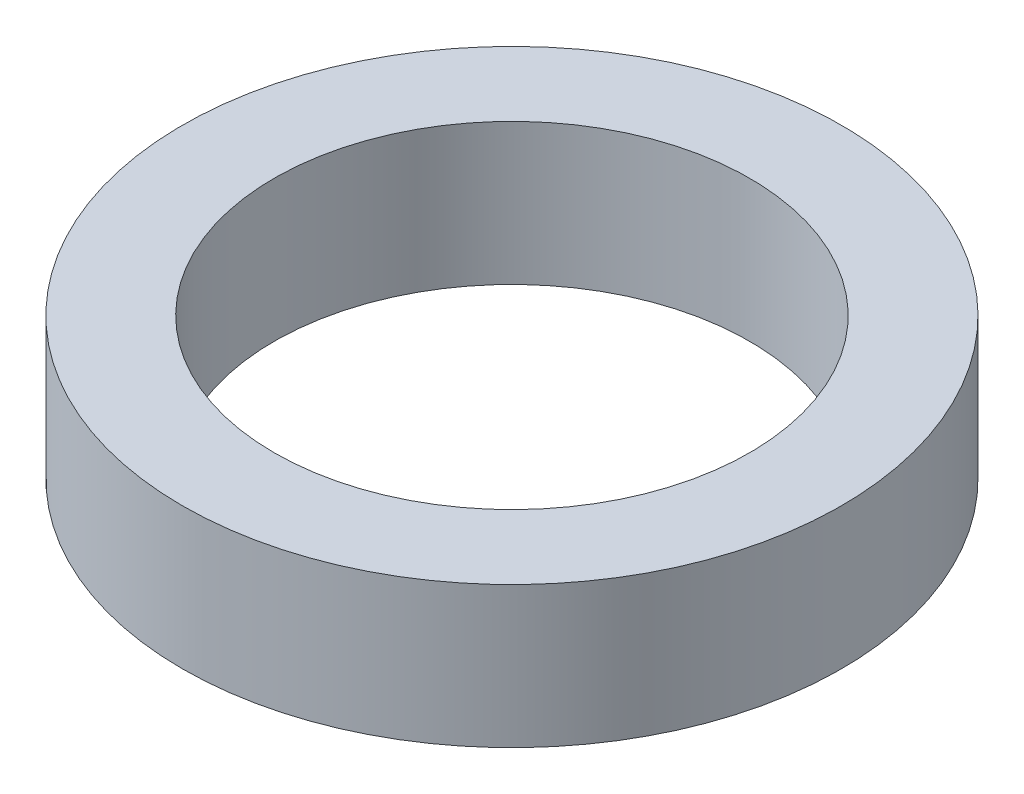
ISO-10303-21;
HEADER;
FILE_DESCRIPTION(('STEP AP214'),'2;1');
FILE_NAME('part.step','',(''),(''),'','','');
FILE_SCHEMA(('AUTOMOTIVE_DESIGN { 1 0 10303 214 1 1 1 1 }'));
ENDSEC;
DATA;
#1=APPLICATION_CONTEXT('core data for automotive mechanical design processes');
#2=APPLICATION_PROTOCOL_DEFINITION('international standard','automotive_design',2000,#1);
#3=PRODUCT_CONTEXT('',#1,'mechanical');
#4=PRODUCT('Part','Part','',(#3));
#5=PRODUCT_RELATED_PRODUCT_CATEGORY('part','',(#4));
#6=PRODUCT_DEFINITION_FORMATION('','',#4);
#7=PRODUCT_DEFINITION_CONTEXT('part definition',#1,'design');
#8=PRODUCT_DEFINITION('design','',#6,#7);
#9=PRODUCT_DEFINITION_SHAPE('','',#8);
#10=(LENGTH_UNIT() NAMED_UNIT(*) SI_UNIT(.MILLI.,.METRE.));
#11=(NAMED_UNIT(*) PLANE_ANGLE_UNIT() SI_UNIT($,.RADIAN.));
#12=(NAMED_UNIT(*) SI_UNIT($,.STERADIAN.) SOLID_ANGLE_UNIT());
#13=UNCERTAINTY_MEASURE_WITH_UNIT(LENGTH_MEASURE(1.E-05),#10,'distance_accuracy_value','');
#14=(GEOMETRIC_REPRESENTATION_CONTEXT(3) GLOBAL_UNCERTAINTY_ASSIGNED_CONTEXT((#13)) GLOBAL_UNIT_ASSIGNED_CONTEXT((#10,
#11,#12)) REPRESENTATION_CONTEXT('',''));
#15=CARTESIAN_POINT('',(0.,0.,0.));
#16=DIRECTION('',(0.,0.,1.));
#17=DIRECTION('',(1.,0.,0.));
#18=AXIS2_PLACEMENT_3D('',#15,#16,#17);
#19=CARTESIAN_POINT('',(0.,1.5,0.));
#20=DIRECTION('',(0.,1.,0.));
#21=DIRECTION('',(0.,0.,1.));
#22=AXIS2_PLACEMENT_3D('',#19,#20,#21);
#23=PLANE('',#22);
#24=CARTESIAN_POINT('',(0.,1.5,0.));
#25=DIRECTION('',(0.,1.,0.));
#26=DIRECTION('',(0.,0.,1.));
#27=AXIS2_PLACEMENT_3D('',#24,#25,#26);
#28=CIRCLE('',#27,3.5);
#29=CARTESIAN_POINT('',(0.,1.5,3.5));
#30=VERTEX_POINT('',#29);
#31=EDGE_CURVE('E10',#30,#30,#28,.T.);
#32=ORIENTED_EDGE('',*,*,#31,.T.);
#33=EDGE_LOOP('',(#32));
#34=FACE_BOUND('',#33,.T.);
#35=CARTESIAN_POINT('',(0.,1.5,0.));
#36=DIRECTION('',(0.,1.,0.));
#37=DIRECTION('',(0.,0.,1.));
#38=AXIS2_PLACEMENT_3D('',#35,#36,#37);
#39=CIRCLE('',#38,2.525);
#40=CARTESIAN_POINT('',(0.,1.5,2.525));
#41=VERTEX_POINT('',#40);
#42=EDGE_CURVE('E50',#41,#41,#39,.T.);
#43=ORIENTED_EDGE('',*,*,#42,.F.);
#44=EDGE_LOOP('',(#43));
#45=FACE_BOUND('',#44,.T.);
#46=ADVANCED_FACE('F37',(#34,#45),#23,.T.);
#47=CARTESIAN_POINT('',(0.,0.,0.));
#48=DIRECTION('',(0.,1.,0.));
#49=DIRECTION('',(0.,0.,1.));
#50=AXIS2_PLACEMENT_3D('',#47,#48,#49);
#51=PLANE('',#50);
#52=CARTESIAN_POINT('',(0.,0.,0.));
#53=DIRECTION('',(0.,1.,0.));
#54=DIRECTION('',(0.,0.,1.));
#55=AXIS2_PLACEMENT_3D('',#52,#53,#54);
#56=CIRCLE('',#55,3.5);
#57=CARTESIAN_POINT('',(0.,0.,3.5));
#58=VERTEX_POINT('',#57);
#59=EDGE_CURVE('E41',#58,#58,#56,.T.);
#60=ORIENTED_EDGE('',*,*,#59,.F.);
#61=EDGE_LOOP('',(#60));
#62=FACE_BOUND('',#61,.T.);
#63=CARTESIAN_POINT('',(0.,0.,0.));
#64=DIRECTION('',(0.,1.,0.));
#65=DIRECTION('',(0.,0.,1.));
#66=AXIS2_PLACEMENT_3D('',#63,#64,#65);
#67=CIRCLE('',#66,2.525);
#68=CARTESIAN_POINT('',(0.,0.,2.525));
#69=VERTEX_POINT('',#68);
#70=EDGE_CURVE('E52',#69,#69,#67,.T.);
#71=ORIENTED_EDGE('',*,*,#70,.T.);
#72=EDGE_LOOP('',(#71));
#73=FACE_BOUND('',#72,.T.);
#74=ADVANCED_FACE('F64',(#62,#73),#51,.F.);
#75=CARTESIAN_POINT('',(0.,1.5,0.));
#76=DIRECTION('',(0.,-1.,0.));
#77=DIRECTION('',(0.,0.,-1.));
#78=AXIS2_PLACEMENT_3D('',#75,#76,#77);
#79=CYLINDRICAL_SURFACE('',#78,3.5);
#80=ORIENTED_EDGE('',*,*,#31,.F.);
#81=EDGE_LOOP('',(#80));
#82=FACE_BOUND('',#81,.T.);
#83=ORIENTED_EDGE('',*,*,#59,.T.);
#84=EDGE_LOOP('',(#83));
#85=FACE_BOUND('',#84,.T.);
#86=ADVANCED_FACE('F39',(#82,#85),#79,.T.);
#87=CARTESIAN_POINT('',(0.,1.5,0.));
#88=DIRECTION('',(0.,-1.,0.));
#89=DIRECTION('',(0.,0.,-1.));
#90=AXIS2_PLACEMENT_3D('',#87,#88,#89);
#91=CYLINDRICAL_SURFACE('',#90,2.525);
#92=ORIENTED_EDGE('',*,*,#42,.T.);
#93=EDGE_LOOP('',(#92));
#94=FACE_BOUND('',#93,.T.);
#95=ORIENTED_EDGE('',*,*,#70,.F.);
#96=EDGE_LOOP('',(#95));
#97=FACE_BOUND('',#96,.T.);
#98=ADVANCED_FACE('F60',(#94,#97),#91,.F.);
#99=CLOSED_SHELL('',(#46,#74,#86,#98));
#100=MANIFOLD_SOLID_BREP('B2',#99);
#101=ADVANCED_BREP_SHAPE_REPRESENTATION('',(#18,#100),#14);
#102=SHAPE_DEFINITION_REPRESENTATION(#9,#101);
ENDSEC;
END-ISO-10303-21;
